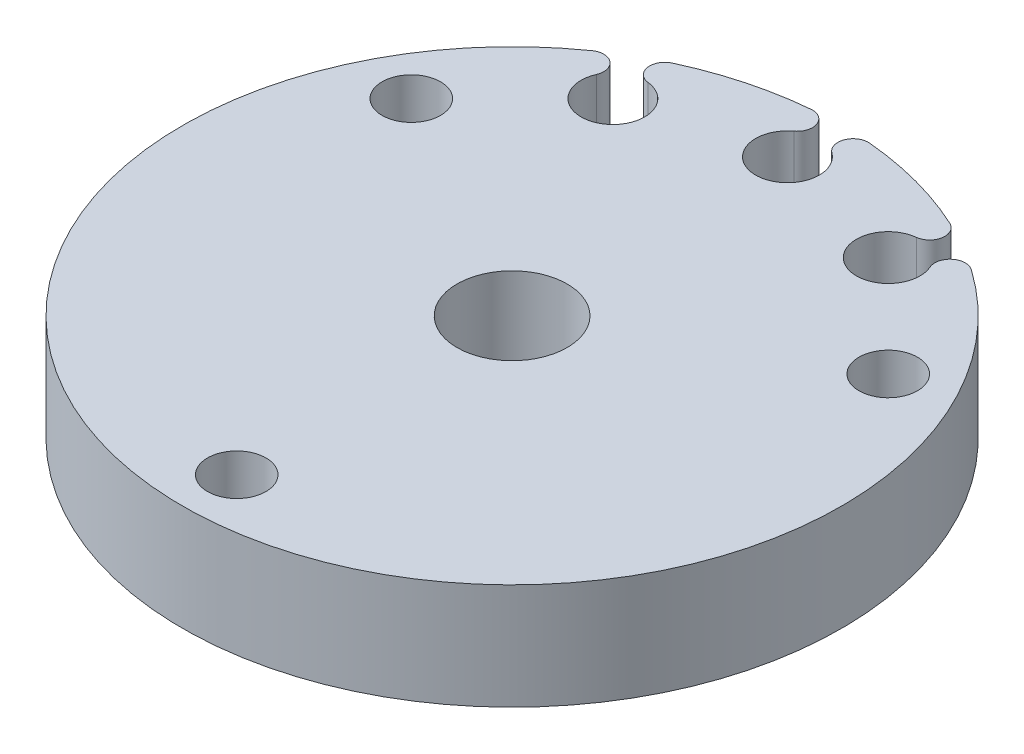
ISO-10303-21;
HEADER;
FILE_DESCRIPTION(('STEP AP214'),'2;1');
FILE_NAME('part.step','',(''),(''),'','','');
FILE_SCHEMA(('AUTOMOTIVE_DESIGN { 1 0 10303 214 1 1 1 1 }'));
ENDSEC;
DATA;
#1=APPLICATION_CONTEXT('core data for automotive mechanical design processes');
#2=APPLICATION_PROTOCOL_DEFINITION('international standard','automotive_design',2000,#1);
#3=PRODUCT_CONTEXT('',#1,'mechanical');
#4=PRODUCT('Part','Part','',(#3));
#5=PRODUCT_RELATED_PRODUCT_CATEGORY('part','',(#4));
#6=PRODUCT_DEFINITION_FORMATION('','',#4);
#7=PRODUCT_DEFINITION_CONTEXT('part definition',#1,'design');
#8=PRODUCT_DEFINITION('design','',#6,#7);
#9=PRODUCT_DEFINITION_SHAPE('','',#8);
#10=(LENGTH_UNIT() NAMED_UNIT(*) SI_UNIT(.MILLI.,.METRE.));
#11=(NAMED_UNIT(*) PLANE_ANGLE_UNIT() SI_UNIT($,.RADIAN.));
#12=(NAMED_UNIT(*) SI_UNIT($,.STERADIAN.) SOLID_ANGLE_UNIT());
#13=UNCERTAINTY_MEASURE_WITH_UNIT(LENGTH_MEASURE(1.E-05),#10,'distance_accuracy_value','');
#14=(GEOMETRIC_REPRESENTATION_CONTEXT(3) GLOBAL_UNCERTAINTY_ASSIGNED_CONTEXT((#13)) GLOBAL_UNIT_ASSIGNED_CONTEXT((#10,
#11,#12)) REPRESENTATION_CONTEXT('',''));
#15=CARTESIAN_POINT('',(0.,0.,0.));
#16=DIRECTION('',(0.,0.,1.));
#17=DIRECTION('',(1.,0.,0.));
#18=AXIS2_PLACEMENT_3D('',#15,#16,#17);
#19=CARTESIAN_POINT('',(0.,6.35,0.));
#20=DIRECTION('',(0.,-1.,0.));
#21=DIRECTION('',(0.,0.,-1.));
#22=AXIS2_PLACEMENT_3D('',#19,#20,#21);
#23=CYLINDRICAL_SURFACE('',#22,19.75);
#24=DIRECTION('',(0.,1.,0.));
#25=VECTOR('',#24,1.);
#26=CARTESIAN_POINT('',(-11.3545625208397,0.,-16.1597156522119));
#27=LINE('',#26,#25);
#28=CARTESIAN_POINT('',(-11.3545625208397,0.,-16.1597156522119));
#29=VERTEX_POINT('',#28);
#30=CARTESIAN_POINT('',(-11.3545625208397,6.35,-16.1597156522119));
#31=VERTEX_POINT('',#30);
#32=EDGE_CURVE('E138',#29,#31,#27,.T.);
#33=ORIENTED_EDGE('',*,*,#32,.F.);
#34=CARTESIAN_POINT('',(0.,0.,0.));
#35=DIRECTION('',(0.,1.,0.));
#36=DIRECTION('',(0.,0.,1.));
#37=AXIS2_PLACEMENT_3D('',#34,#35,#36);
#38=CIRCLE('',#37,19.75);
#39=CARTESIAN_POINT('',(11.3545625208397,0.,-16.1597156522119));
#40=VERTEX_POINT('',#39);
#41=EDGE_CURVE('E151',#29,#40,#38,.T.);
#42=ORIENTED_EDGE('',*,*,#41,.T.);
#43=DIRECTION('',(0.,1.,0.));
#44=VECTOR('',#43,1.);
#45=CARTESIAN_POINT('',(11.3545625208397,0.,-16.1597156522119));
#46=LINE('',#45,#44);
#47=CARTESIAN_POINT('',(11.3545625208397,6.35,-16.1597156522119));
#48=VERTEX_POINT('',#47);
#49=EDGE_CURVE('E186',#40,#48,#46,.T.);
#50=ORIENTED_EDGE('',*,*,#49,.T.);
#51=CARTESIAN_POINT('',(0.,6.35,0.));
#52=DIRECTION('',(0.,1.,0.));
#53=DIRECTION('',(0.,0.,1.));
#54=AXIS2_PLACEMENT_3D('',#51,#52,#53);
#55=CIRCLE('',#54,19.75);
#56=EDGE_CURVE('E47',#31,#48,#55,.T.);
#57=ORIENTED_EDGE('',*,*,#56,.F.);
#58=EDGE_LOOP('',(#33,#42,#50,#57));
#59=FACE_BOUND('',#58,.T.);
#60=ADVANCED_FACE('F37',(#59),#23,.T.);
#61=CARTESIAN_POINT('',(-1.7534817657999,0.,-19.6720055331684));
#62=VERTEX_POINT('',#61);
#63=CARTESIAN_POINT('',(-8.31744301232874,0.,-17.9131974180118));
#64=VERTEX_POINT('',#63);
#65=EDGE_CURVE('E144',#62,#64,#38,.T.);
#66=ORIENTED_EDGE('',*,*,#65,.T.);
#67=DIRECTION('',(0.,1.,0.));
#68=VECTOR('',#67,1.);
#69=CARTESIAN_POINT('',(-8.31744301232874,0.,-17.9131974180118));
#70=LINE('',#69,#68);
#71=CARTESIAN_POINT('',(-8.31744301232874,6.35,-17.9131974180118));
#72=VERTEX_POINT('',#71);
#73=EDGE_CURVE('E128',#64,#72,#70,.T.);
#74=ORIENTED_EDGE('',*,*,#73,.T.);
#75=CARTESIAN_POINT('',(-1.7534817657999,6.35,-19.6720055331684));
#76=VERTEX_POINT('',#75);
#77=EDGE_CURVE('E46',#76,#72,#55,.T.);
#78=ORIENTED_EDGE('',*,*,#77,.F.);
#79=DIRECTION('',(0.,1.,0.));
#80=VECTOR('',#79,1.);
#81=CARTESIAN_POINT('',(-1.7534817657999,0.,-19.6720055331684));
#82=LINE('',#81,#80);
#83=EDGE_CURVE('E150',#62,#76,#82,.T.);
#84=ORIENTED_EDGE('',*,*,#83,.F.);
#85=EDGE_LOOP('',(#66,#74,#78,#84));
#86=FACE_BOUND('',#85,.T.);
#87=ADVANCED_FACE('F149',(#86),#23,.T.);
#88=CARTESIAN_POINT('',(0.,6.35,0.));
#89=DIRECTION('',(0.,1.,0.));
#90=DIRECTION('',(0.,0.,1.));
#91=AXIS2_PLACEMENT_3D('',#88,#89,#90);
#92=PLANE('',#91);
#93=CARTESIAN_POINT('',(-7.93394264831237,6.35,-17.0872563541149));
#94=DIRECTION('',(0.,-1.,0.));
#95=DIRECTION('',(0.86602540378444,0.,0.499999999999998));
#96=AXIS2_PLACEMENT_3D('',#93,#94,#95);
#97=CIRCLE('',#96,0.910632291450185);
#98=CARTESIAN_POINT('',(-8.03616197264353,6.35,-16.1823793569683));
#99=VERTEX_POINT('',#98);
#100=EDGE_CURVE('E133',#99,#72,#97,.T.);
#101=ORIENTED_EDGE('',*,*,#100,.F.);
#102=CARTESIAN_POINT('',(-8.25000000000003,6.35,-14.2894191624432));
#103=DIRECTION('',(0.,1.,0.));
#104=DIRECTION('',(0.86602540378444,0.,0.499999999999998));
#105=AXIS2_PLACEMENT_3D('',#102,#103,#104);
#106=CIRCLE('',#105,1.905);
#107=CARTESIAN_POINT('',(-9.99627063048971,6.35,-15.0507100957198));
#108=VERTEX_POINT('',#107);
#109=EDGE_CURVE('E147',#108,#99,#106,.T.);
#110=ORIENTED_EDGE('',*,*,#109,.F.);
#111=CARTESIAN_POINT('',(-10.8310267594844,6.35,-15.4146240626647));
#112=DIRECTION('',(0.,-1.,0.));
#113=DIRECTION('',(-0.86602540378444,0.,-0.499999999999998));
#114=AXIS2_PLACEMENT_3D('',#111,#112,#113);
#115=CIRCLE('',#114,0.910632291450183);
#116=EDGE_CURVE('E241',#31,#108,#115,.T.);
#117=ORIENTED_EDGE('',*,*,#116,.F.);
#118=ORIENTED_EDGE('',*,*,#56,.T.);
#119=CARTESIAN_POINT('',(10.8310267594844,6.35,-15.4146240626647));
#120=DIRECTION('',(0.,-1.,0.));
#121=DIRECTION('',(0.,0.,1.));
#122=AXIS2_PLACEMENT_3D('',#119,#120,#121);
#123=CIRCLE('',#122,0.910632291450185);
#124=CARTESIAN_POINT('',(9.99627063048967,6.35,-15.0507100957199));
#125=VERTEX_POINT('',#124);
#126=EDGE_CURVE('E201',#125,#48,#123,.T.);
#127=ORIENTED_EDGE('',*,*,#126,.F.);
#128=CARTESIAN_POINT('',(8.25,6.35,-14.2894191624432));
#129=DIRECTION('',(0.,1.,0.));
#130=DIRECTION('',(0.,0.,1.));
#131=AXIS2_PLACEMENT_3D('',#128,#129,#130);
#132=CIRCLE('',#131,1.905);
#133=CARTESIAN_POINT('',(8.03616197264349,6.35,-16.1823793569683));
#134=VERTEX_POINT('',#133);
#135=EDGE_CURVE('E194',#134,#125,#132,.T.);
#136=ORIENTED_EDGE('',*,*,#135,.F.);
#137=CARTESIAN_POINT('',(7.93394264831234,6.35,-17.0872563541149));
#138=DIRECTION('',(0.,-1.,0.));
#139=DIRECTION('',(0.,0.,-1.));
#140=AXIS2_PLACEMENT_3D('',#137,#138,#139);
#141=CIRCLE('',#140,0.910632291450183);
#142=CARTESIAN_POINT('',(8.3174430123287,6.35,-17.9131974180118));
#143=VERTEX_POINT('',#142);
#144=EDGE_CURVE('E198',#143,#134,#141,.T.);
#145=ORIENTED_EDGE('',*,*,#144,.F.);
#146=CARTESIAN_POINT('',(1.75348176579986,6.35,-19.6720055331684));
#147=VERTEX_POINT('',#146);
#148=EDGE_CURVE('E11',#143,#147,#55,.T.);
#149=ORIENTED_EDGE('',*,*,#148,.T.);
#150=CARTESIAN_POINT('',(1.67263229145016,6.35,-18.7649694077967));
#151=DIRECTION('',(0.,-1.,0.));
#152=DIRECTION('',(0.500000000000001,0.,0.866025403784438));
#153=AXIS2_PLACEMENT_3D('',#150,#151,#152);
#154=CIRCLE('',#153,0.910632291450185);
#155=CARTESIAN_POINT('',(1.13166926124839,6.35,-18.0324326031332));
#156=VERTEX_POINT('',#155);
#157=EDGE_CURVE('E227',#156,#147,#154,.T.);
#158=ORIENTED_EDGE('',*,*,#157,.F.);
#159=CARTESIAN_POINT('',(0.,6.35,-16.5));
#160=DIRECTION('',(0.,1.,0.));
#161=DIRECTION('',(0.500000000000001,0.,0.866025403784438));
#162=AXIS2_PLACEMENT_3D('',#159,#160,#161);
#163=CIRCLE('',#162,1.905);
#164=CARTESIAN_POINT('',(-1.13166926124843,6.35,-18.0324326031332));
#165=VERTEX_POINT('',#164);
#166=EDGE_CURVE('E220',#165,#156,#163,.T.);
#167=ORIENTED_EDGE('',*,*,#166,.F.);
#168=CARTESIAN_POINT('',(-1.6726322914502,6.35,-18.7649694077967));
#169=DIRECTION('',(0.,-1.,0.));
#170=DIRECTION('',(-0.500000000000001,0.,-0.866025403784438));
#171=AXIS2_PLACEMENT_3D('',#168,#169,#170);
#172=CIRCLE('',#171,0.910632291450183);
#173=EDGE_CURVE('E224',#76,#165,#172,.T.);
#174=ORIENTED_EDGE('',*,*,#173,.F.);
#175=ORIENTED_EDGE('',*,*,#77,.T.);
#176=EDGE_LOOP('',(#101,#110,#117,#118,#127,#136,#145,#149,#158,#167,#174,#175));
#177=FACE_BOUND('',#176,.T.);
#178=CARTESIAN_POINT('',(0.,6.35,16.5));
#179=DIRECTION('',(0.,1.,0.));
#180=DIRECTION('',(0.,0.,1.));
#181=AXIS2_PLACEMENT_3D('',#178,#179,#180);
#182=CIRCLE('',#181,1.75);
#183=CARTESIAN_POINT('',(0.,6.35,18.25));
#184=VERTEX_POINT('',#183);
#185=EDGE_CURVE('E171',#184,#184,#182,.T.);
#186=ORIENTED_EDGE('',*,*,#185,.F.);
#187=EDGE_LOOP('',(#186));
#188=FACE_BOUND('',#187,.T.);
#189=CARTESIAN_POINT('',(0.,6.35,0.));
#190=DIRECTION('',(0.,1.,0.));
#191=DIRECTION('',(0.,0.,1.));
#192=AXIS2_PLACEMENT_3D('',#189,#190,#191);
#193=CIRCLE('',#192,3.302);
#194=CARTESIAN_POINT('',(0.,6.35,3.302));
#195=VERTEX_POINT('',#194);
#196=EDGE_CURVE('E153',#195,#195,#193,.T.);
#197=ORIENTED_EDGE('',*,*,#196,.F.);
#198=EDGE_LOOP('',(#197));
#199=FACE_BOUND('',#198,.T.);
#200=CARTESIAN_POINT('',(-14.2894191624432,6.35,-8.25));
#201=DIRECTION('',(0.,1.,0.));
#202=DIRECTION('',(0.,0.,1.));
#203=AXIS2_PLACEMENT_3D('',#200,#201,#202);
#204=CIRCLE('',#203,1.75);
#205=CARTESIAN_POINT('',(-14.2894191624432,6.35,-6.5));
#206=VERTEX_POINT('',#205);
#207=EDGE_CURVE('E165',#206,#206,#204,.T.);
#208=ORIENTED_EDGE('',*,*,#207,.F.);
#209=EDGE_LOOP('',(#208));
#210=FACE_BOUND('',#209,.T.);
#211=CARTESIAN_POINT('',(14.2894191624432,6.35,-8.25));
#212=DIRECTION('',(0.,1.,0.));
#213=DIRECTION('',(0.,0.,1.));
#214=AXIS2_PLACEMENT_3D('',#211,#212,#213);
#215=CIRCLE('',#214,1.75);
#216=CARTESIAN_POINT('',(14.2894191624432,6.35,-6.5));
#217=VERTEX_POINT('',#216);
#218=EDGE_CURVE('E177',#217,#217,#215,.T.);
#219=ORIENTED_EDGE('',*,*,#218,.F.);
#220=EDGE_LOOP('',(#219));
#221=FACE_BOUND('',#220,.T.);
#222=ADVANCED_FACE('F253',(#177,#188,#199,#210,#221),#92,.T.);
#223=CARTESIAN_POINT('',(0.,0.,0.));
#224=DIRECTION('',(0.,1.,0.));
#225=DIRECTION('',(0.,0.,1.));
#226=AXIS2_PLACEMENT_3D('',#223,#224,#225);
#227=PLANE('',#226);
#228=CARTESIAN_POINT('',(0.,0.,16.5));
#229=DIRECTION('',(0.,1.,0.));
#230=DIRECTION('',(0.,0.,1.));
#231=AXIS2_PLACEMENT_3D('',#228,#229,#230);
#232=CIRCLE('',#231,1.75);
#233=CARTESIAN_POINT('',(0.,0.,18.25));
#234=VERTEX_POINT('',#233);
#235=EDGE_CURVE('E174',#234,#234,#232,.T.);
#236=ORIENTED_EDGE('',*,*,#235,.T.);
#237=EDGE_LOOP('',(#236));
#238=FACE_BOUND('',#237,.T.);
#239=CARTESIAN_POINT('',(0.,0.,0.));
#240=DIRECTION('',(0.,1.,0.));
#241=DIRECTION('',(0.,0.,1.));
#242=AXIS2_PLACEMENT_3D('',#239,#240,#241);
#243=CIRCLE('',#242,3.302);
#244=CARTESIAN_POINT('',(0.,0.,3.302));
#245=VERTEX_POINT('',#244);
#246=EDGE_CURVE('E160',#245,#245,#243,.T.);
#247=ORIENTED_EDGE('',*,*,#246,.T.);
#248=EDGE_LOOP('',(#247));
#249=FACE_BOUND('',#248,.T.);
#250=CARTESIAN_POINT('',(-8.25000000000003,0.,-14.2894191624432));
#251=DIRECTION('',(0.,1.,0.));
#252=DIRECTION('',(0.86602540378444,0.,0.499999999999998));
#253=AXIS2_PLACEMENT_3D('',#250,#251,#252);
#254=CIRCLE('',#253,1.905);
#255=CARTESIAN_POINT('',(-9.99627063048971,0.,-15.0507100957198));
#256=VERTEX_POINT('',#255);
#257=CARTESIAN_POINT('',(-8.03616197264353,0.,-16.1823793569683));
#258=VERTEX_POINT('',#257);
#259=EDGE_CURVE('E54',#256,#258,#254,.T.);
#260=ORIENTED_EDGE('',*,*,#259,.T.);
#261=CARTESIAN_POINT('',(-7.93394264831237,0.,-17.0872563541149));
#262=DIRECTION('',(0.,-1.,0.));
#263=DIRECTION('',(0.86602540378444,0.,0.499999999999998));
#264=AXIS2_PLACEMENT_3D('',#261,#262,#263);
#265=CIRCLE('',#264,0.910632291450185);
#266=EDGE_CURVE('E131',#258,#64,#265,.T.);
#267=ORIENTED_EDGE('',*,*,#266,.T.);
#268=ORIENTED_EDGE('',*,*,#65,.F.);
#269=CARTESIAN_POINT('',(-1.6726322914502,0.,-18.7649694077967));
#270=DIRECTION('',(0.,-1.,0.));
#271=DIRECTION('',(-0.500000000000001,0.,-0.866025403784438));
#272=AXIS2_PLACEMENT_3D('',#269,#270,#271);
#273=CIRCLE('',#272,0.910632291450183);
#274=CARTESIAN_POINT('',(-1.13166926124843,0.,-18.0324326031332));
#275=VERTEX_POINT('',#274);
#276=EDGE_CURVE('E62',#62,#275,#273,.T.);
#277=ORIENTED_EDGE('',*,*,#276,.T.);
#278=CARTESIAN_POINT('',(0.,0.,-16.5));
#279=DIRECTION('',(0.,1.,0.));
#280=DIRECTION('',(0.500000000000001,0.,0.866025403784438));
#281=AXIS2_PLACEMENT_3D('',#278,#279,#280);
#282=CIRCLE('',#281,1.905);
#283=CARTESIAN_POINT('',(1.13166926124839,0.,-18.0324326031332));
#284=VERTEX_POINT('',#283);
#285=EDGE_CURVE('E215',#275,#284,#282,.T.);
#286=ORIENTED_EDGE('',*,*,#285,.T.);
#287=CARTESIAN_POINT('',(1.67263229145016,0.,-18.7649694077967));
#288=DIRECTION('',(0.,-1.,0.));
#289=DIRECTION('',(0.500000000000001,0.,0.866025403784438));
#290=AXIS2_PLACEMENT_3D('',#287,#288,#289);
#291=CIRCLE('',#290,0.910632291450185);
#292=CARTESIAN_POINT('',(1.75348176579986,0.,-19.6720055331684));
#293=VERTEX_POINT('',#292);
#294=EDGE_CURVE('E223',#284,#293,#291,.T.);
#295=ORIENTED_EDGE('',*,*,#294,.T.);
#296=CARTESIAN_POINT('',(8.3174430123287,0.,-17.9131974180118));
#297=VERTEX_POINT('',#296);
#298=EDGE_CURVE('E41',#297,#293,#38,.T.);
#299=ORIENTED_EDGE('',*,*,#298,.F.);
#300=CARTESIAN_POINT('',(7.93394264831234,0.,-17.0872563541149));
#301=DIRECTION('',(0.,-1.,0.));
#302=DIRECTION('',(0.,0.,-1.));
#303=AXIS2_PLACEMENT_3D('',#300,#301,#302);
#304=CIRCLE('',#303,0.910632291450183);
#305=CARTESIAN_POINT('',(8.03616197264349,0.,-16.1823793569683));
#306=VERTEX_POINT('',#305);
#307=EDGE_CURVE('E207',#297,#306,#304,.T.);
#308=ORIENTED_EDGE('',*,*,#307,.T.);
#309=CARTESIAN_POINT('',(8.25,0.,-14.2894191624432));
#310=DIRECTION('',(0.,1.,0.));
#311=DIRECTION('',(0.,0.,1.));
#312=AXIS2_PLACEMENT_3D('',#309,#310,#311);
#313=CIRCLE('',#312,1.905);
#314=CARTESIAN_POINT('',(9.99627063048967,0.,-15.0507100957199));
#315=VERTEX_POINT('',#314);
#316=EDGE_CURVE('E189',#306,#315,#313,.T.);
#317=ORIENTED_EDGE('',*,*,#316,.T.);
#318=CARTESIAN_POINT('',(10.8310267594844,0.,-15.4146240626647));
#319=DIRECTION('',(0.,-1.,0.));
#320=DIRECTION('',(0.,0.,1.));
#321=AXIS2_PLACEMENT_3D('',#318,#319,#320);
#322=CIRCLE('',#321,0.910632291450185);
#323=EDGE_CURVE('E197',#315,#40,#322,.T.);
#324=ORIENTED_EDGE('',*,*,#323,.T.);
#325=ORIENTED_EDGE('',*,*,#41,.F.);
#326=CARTESIAN_POINT('',(-10.8310267594844,0.,-15.4146240626647));
#327=DIRECTION('',(0.,-1.,0.));
#328=DIRECTION('',(-0.86602540378444,0.,-0.499999999999998));
#329=AXIS2_PLACEMENT_3D('',#326,#327,#328);
#330=CIRCLE('',#329,0.910632291450183);
#331=EDGE_CURVE('E146',#29,#256,#330,.T.);
#332=ORIENTED_EDGE('',*,*,#331,.T.);
#333=EDGE_LOOP('',(#260,#267,#268,#277,#286,#295,#299,#308,#317,#324,#325,#332));
#334=FACE_BOUND('',#333,.T.);
#335=CARTESIAN_POINT('',(-14.2894191624432,0.,-8.25));
#336=DIRECTION('',(0.,1.,0.));
#337=DIRECTION('',(0.,0.,1.));
#338=AXIS2_PLACEMENT_3D('',#335,#336,#337);
#339=CIRCLE('',#338,1.75);
#340=CARTESIAN_POINT('',(-14.2894191624432,0.,-6.5));
#341=VERTEX_POINT('',#340);
#342=EDGE_CURVE('E168',#341,#341,#339,.T.);
#343=ORIENTED_EDGE('',*,*,#342,.T.);
#344=EDGE_LOOP('',(#343));
#345=FACE_BOUND('',#344,.T.);
#346=CARTESIAN_POINT('',(14.2894191624432,0.,-8.25));
#347=DIRECTION('',(0.,1.,0.));
#348=DIRECTION('',(0.,0.,1.));
#349=AXIS2_PLACEMENT_3D('',#346,#347,#348);
#350=CIRCLE('',#349,1.75);
#351=CARTESIAN_POINT('',(14.2894191624432,0.,-6.5));
#352=VERTEX_POINT('',#351);
#353=EDGE_CURVE('E180',#352,#352,#350,.T.);
#354=ORIENTED_EDGE('',*,*,#353,.T.);
#355=EDGE_LOOP('',(#354));
#356=FACE_BOUND('',#355,.T.);
#357=ADVANCED_FACE('F142',(#238,#249,#334,#345,#356),#227,.F.);
#358=ORIENTED_EDGE('',*,*,#298,.T.);
#359=DIRECTION('',(0.,1.,0.));
#360=VECTOR('',#359,1.);
#361=CARTESIAN_POINT('',(1.75348176579986,0.,-19.6720055331684));
#362=LINE('',#361,#360);
#363=EDGE_CURVE('E212',#293,#147,#362,.T.);
#364=ORIENTED_EDGE('',*,*,#363,.T.);
#365=ORIENTED_EDGE('',*,*,#148,.F.);
#366=DIRECTION('',(0.,1.,0.));
#367=VECTOR('',#366,1.);
#368=CARTESIAN_POINT('',(8.3174430123287,0.,-17.9131974180118));
#369=LINE('',#368,#367);
#370=EDGE_CURVE('E188',#297,#143,#369,.T.);
#371=ORIENTED_EDGE('',*,*,#370,.F.);
#372=EDGE_LOOP('',(#358,#364,#365,#371));
#373=FACE_BOUND('',#372,.T.);
#374=ADVANCED_FACE('F39',(#373),#23,.T.);
#375=CARTESIAN_POINT('',(0.,6.35,0.));
#376=DIRECTION('',(0.,-1.,0.));
#377=DIRECTION('',(0.,0.,-1.));
#378=AXIS2_PLACEMENT_3D('',#375,#376,#377);
#379=CYLINDRICAL_SURFACE('',#378,3.302);
#380=ORIENTED_EDGE('',*,*,#196,.T.);
#381=EDGE_LOOP('',(#380));
#382=FACE_BOUND('',#381,.T.);
#383=ORIENTED_EDGE('',*,*,#246,.F.);
#384=EDGE_LOOP('',(#383));
#385=FACE_BOUND('',#384,.T.);
#386=ADVANCED_FACE('F295',(#382,#385),#379,.F.);
#387=CARTESIAN_POINT('',(-14.2894191624432,6.35,-8.25));
#388=DIRECTION('',(0.,-1.,0.));
#389=DIRECTION('',(0.,0.,-1.));
#390=AXIS2_PLACEMENT_3D('',#387,#388,#389);
#391=CYLINDRICAL_SURFACE('',#390,1.75);
#392=ORIENTED_EDGE('',*,*,#207,.T.);
#393=EDGE_LOOP('',(#392));
#394=FACE_BOUND('',#393,.T.);
#395=ORIENTED_EDGE('',*,*,#342,.F.);
#396=EDGE_LOOP('',(#395));
#397=FACE_BOUND('',#396,.T.);
#398=ADVANCED_FACE('F300',(#394,#397),#391,.F.);
#399=CARTESIAN_POINT('',(0.,6.35,16.5));
#400=DIRECTION('',(0.,-1.,0.));
#401=DIRECTION('',(0.,0.,-1.));
#402=AXIS2_PLACEMENT_3D('',#399,#400,#401);
#403=CYLINDRICAL_SURFACE('',#402,1.75);
#404=ORIENTED_EDGE('',*,*,#185,.T.);
#405=EDGE_LOOP('',(#404));
#406=FACE_BOUND('',#405,.T.);
#407=ORIENTED_EDGE('',*,*,#235,.F.);
#408=EDGE_LOOP('',(#407));
#409=FACE_BOUND('',#408,.T.);
#410=ADVANCED_FACE('F286',(#406,#409),#403,.F.);
#411=CARTESIAN_POINT('',(14.2894191624432,6.35,-8.25));
#412=DIRECTION('',(0.,-1.,0.));
#413=DIRECTION('',(0.,0.,-1.));
#414=AXIS2_PLACEMENT_3D('',#411,#412,#413);
#415=CYLINDRICAL_SURFACE('',#414,1.75);
#416=ORIENTED_EDGE('',*,*,#218,.T.);
#417=EDGE_LOOP('',(#416));
#418=FACE_BOUND('',#417,.T.);
#419=ORIENTED_EDGE('',*,*,#353,.F.);
#420=EDGE_LOOP('',(#419));
#421=FACE_BOUND('',#420,.T.);
#422=ADVANCED_FACE('F279',(#418,#421),#415,.F.);
#423=CARTESIAN_POINT('',(10.8310267594844,0.,-15.4146240626647));
#424=DIRECTION('',(0.,1.,0.));
#425=DIRECTION('',(0.,0.,1.));
#426=AXIS2_PLACEMENT_3D('',#423,#424,#425);
#427=CYLINDRICAL_SURFACE('',#426,0.910632291450185);
#428=ORIENTED_EDGE('',*,*,#126,.T.);
#429=ORIENTED_EDGE('',*,*,#49,.F.);
#430=ORIENTED_EDGE('',*,*,#323,.F.);
#431=DIRECTION('',(0.,1.,0.));
#432=VECTOR('',#431,1.);
#433=CARTESIAN_POINT('',(9.99627063048967,0.,-15.0507100957199));
#434=LINE('',#433,#432);
#435=EDGE_CURVE('E183',#315,#125,#434,.T.);
#436=ORIENTED_EDGE('',*,*,#435,.T.);
#437=EDGE_LOOP('',(#428,#429,#430,#436));
#438=FACE_BOUND('',#437,.T.);
#439=ADVANCED_FACE('F277',(#438),#427,.T.);
#440=CARTESIAN_POINT('',(8.25,0.,-14.2894191624432));
#441=DIRECTION('',(0.,1.,0.));
#442=DIRECTION('',(0.,0.,1.));
#443=AXIS2_PLACEMENT_3D('',#440,#441,#442);
#444=CYLINDRICAL_SURFACE('',#443,1.905);
#445=ORIENTED_EDGE('',*,*,#135,.T.);
#446=ORIENTED_EDGE('',*,*,#435,.F.);
#447=ORIENTED_EDGE('',*,*,#316,.F.);
#448=DIRECTION('',(0.,1.,0.));
#449=VECTOR('',#448,1.);
#450=CARTESIAN_POINT('',(8.03616197264349,0.,-16.1823793569683));
#451=LINE('',#450,#449);
#452=EDGE_CURVE('E191',#306,#134,#451,.T.);
#453=ORIENTED_EDGE('',*,*,#452,.T.);
#454=EDGE_LOOP('',(#445,#446,#447,#453));
#455=FACE_BOUND('',#454,.T.);
#456=ADVANCED_FACE('F273',(#455),#444,.F.);
#457=CARTESIAN_POINT('',(7.93394264831234,0.,-17.0872563541149));
#458=DIRECTION('',(0.,1.,0.));
#459=DIRECTION('',(0.,0.,1.));
#460=AXIS2_PLACEMENT_3D('',#457,#458,#459);
#461=CYLINDRICAL_SURFACE('',#460,0.910632291450183);
#462=ORIENTED_EDGE('',*,*,#144,.T.);
#463=ORIENTED_EDGE('',*,*,#452,.F.);
#464=ORIENTED_EDGE('',*,*,#307,.F.);
#465=ORIENTED_EDGE('',*,*,#370,.T.);
#466=EDGE_LOOP('',(#462,#463,#464,#465));
#467=FACE_BOUND('',#466,.T.);
#468=ADVANCED_FACE('F270',(#467),#461,.T.);
#469=CARTESIAN_POINT('',(1.67263229145016,0.,-18.7649694077967));
#470=DIRECTION('',(0.,1.,0.));
#471=DIRECTION('',(0.,0.,1.));
#472=AXIS2_PLACEMENT_3D('',#469,#470,#471);
#473=CYLINDRICAL_SURFACE('',#472,0.910632291450185);
#474=ORIENTED_EDGE('',*,*,#157,.T.);
#475=ORIENTED_EDGE('',*,*,#363,.F.);
#476=ORIENTED_EDGE('',*,*,#294,.F.);
#477=DIRECTION('',(0.,1.,0.));
#478=VECTOR('',#477,1.);
#479=CARTESIAN_POINT('',(1.13166926124839,0.,-18.0324326031332));
#480=LINE('',#479,#478);
#481=EDGE_CURVE('E204',#284,#156,#480,.T.);
#482=ORIENTED_EDGE('',*,*,#481,.T.);
#483=EDGE_LOOP('',(#474,#475,#476,#482));
#484=FACE_BOUND('',#483,.T.);
#485=ADVANCED_FACE('F353',(#484),#473,.T.);
#486=CARTESIAN_POINT('',(0.,0.,-16.5));
#487=DIRECTION('',(0.,1.,0.));
#488=DIRECTION('',(0.,0.,1.));
#489=AXIS2_PLACEMENT_3D('',#486,#487,#488);
#490=CYLINDRICAL_SURFACE('',#489,1.905);
#491=ORIENTED_EDGE('',*,*,#166,.T.);
#492=ORIENTED_EDGE('',*,*,#481,.F.);
#493=ORIENTED_EDGE('',*,*,#285,.F.);
#494=DIRECTION('',(0.,1.,0.));
#495=VECTOR('',#494,1.);
#496=CARTESIAN_POINT('',(-1.13166926124843,0.,-18.0324326031332));
#497=LINE('',#496,#495);
#498=EDGE_CURVE('E217',#275,#165,#497,.T.);
#499=ORIENTED_EDGE('',*,*,#498,.T.);
#500=EDGE_LOOP('',(#491,#492,#493,#499));
#501=FACE_BOUND('',#500,.T.);
#502=ADVANCED_FACE('F261',(#501),#490,.F.);
#503=CARTESIAN_POINT('',(-1.6726322914502,0.,-18.7649694077967));
#504=DIRECTION('',(0.,1.,0.));
#505=DIRECTION('',(0.,0.,1.));
#506=AXIS2_PLACEMENT_3D('',#503,#504,#505);
#507=CYLINDRICAL_SURFACE('',#506,0.910632291450183);
#508=ORIENTED_EDGE('',*,*,#173,.T.);
#509=ORIENTED_EDGE('',*,*,#498,.F.);
#510=ORIENTED_EDGE('',*,*,#276,.F.);
#511=ORIENTED_EDGE('',*,*,#83,.T.);
#512=EDGE_LOOP('',(#508,#509,#510,#511));
#513=FACE_BOUND('',#512,.T.);
#514=ADVANCED_FACE('F258',(#513),#507,.T.);
#515=CARTESIAN_POINT('',(-7.93394264831237,0.,-17.0872563541149));
#516=DIRECTION('',(0.,1.,0.));
#517=DIRECTION('',(0.,0.,1.));
#518=AXIS2_PLACEMENT_3D('',#515,#516,#517);
#519=CYLINDRICAL_SURFACE('',#518,0.910632291450185);
#520=ORIENTED_EDGE('',*,*,#100,.T.);
#521=ORIENTED_EDGE('',*,*,#73,.F.);
#522=ORIENTED_EDGE('',*,*,#266,.F.);
#523=DIRECTION('',(0.,1.,0.));
#524=VECTOR('',#523,1.);
#525=CARTESIAN_POINT('',(-8.03616197264353,0.,-16.1823793569683));
#526=LINE('',#525,#524);
#527=EDGE_CURVE('E229',#258,#99,#526,.T.);
#528=ORIENTED_EDGE('',*,*,#527,.T.);
#529=EDGE_LOOP('',(#520,#521,#522,#528));
#530=FACE_BOUND('',#529,.T.);
#531=ADVANCED_FACE('F130',(#530),#519,.T.);
#532=CARTESIAN_POINT('',(-8.25000000000003,0.,-14.2894191624432));
#533=DIRECTION('',(0.,1.,0.));
#534=DIRECTION('',(0.,0.,1.));
#535=AXIS2_PLACEMENT_3D('',#532,#533,#534);
#536=CYLINDRICAL_SURFACE('',#535,1.905);
#537=ORIENTED_EDGE('',*,*,#109,.T.);
#538=ORIENTED_EDGE('',*,*,#527,.F.);
#539=ORIENTED_EDGE('',*,*,#259,.F.);
#540=DIRECTION('',(0.,1.,0.));
#541=VECTOR('',#540,1.);
#542=CARTESIAN_POINT('',(-9.99627063048971,0.,-15.0507100957198));
#543=LINE('',#542,#541);
#544=EDGE_CURVE('E236',#256,#108,#543,.T.);
#545=ORIENTED_EDGE('',*,*,#544,.T.);
#546=EDGE_LOOP('',(#537,#538,#539,#545));
#547=FACE_BOUND('',#546,.T.);
#548=ADVANCED_FACE('F411',(#547),#536,.F.);
#549=CARTESIAN_POINT('',(-10.8310267594844,0.,-15.4146240626647));
#550=DIRECTION('',(0.,1.,0.));
#551=DIRECTION('',(0.,0.,1.));
#552=AXIS2_PLACEMENT_3D('',#549,#550,#551);
#553=CYLINDRICAL_SURFACE('',#552,0.910632291450183);
#554=ORIENTED_EDGE('',*,*,#116,.T.);
#555=ORIENTED_EDGE('',*,*,#544,.F.);
#556=ORIENTED_EDGE('',*,*,#331,.F.);
#557=ORIENTED_EDGE('',*,*,#32,.T.);
#558=EDGE_LOOP('',(#554,#555,#556,#557));
#559=FACE_BOUND('',#558,.T.);
#560=ADVANCED_FACE('F247',(#559),#553,.T.);
#561=CLOSED_SHELL('',(#60,#87,#222,#357,#374,#386,#398,#410,#422,#439,#456,#468,#485,#502,#514,
#531,#548,#560));
#562=MANIFOLD_SOLID_BREP('B2',#561);
#563=ADVANCED_BREP_SHAPE_REPRESENTATION('',(#18,#562),#14);
#564=SHAPE_DEFINITION_REPRESENTATION(#9,#563);
ENDSEC;
END-ISO-10303-21;
